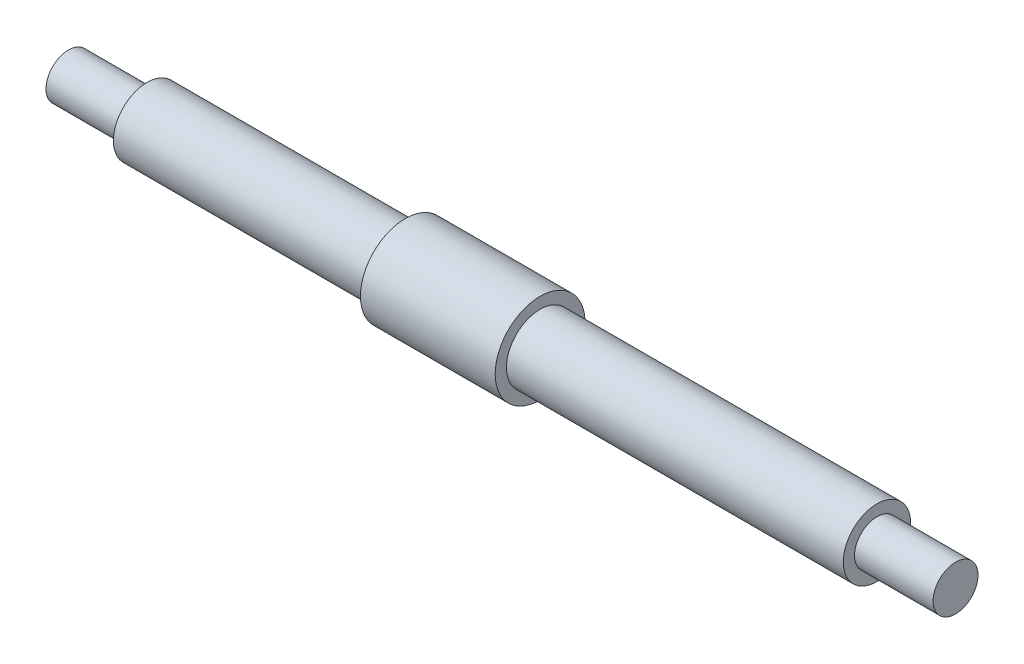
ISO-10303-21;
HEADER;
FILE_DESCRIPTION(('STEP AP214'),'2;1');
FILE_NAME('part.step','',(''),(''),'','','');
FILE_SCHEMA(('AUTOMOTIVE_DESIGN { 1 0 10303 214 1 1 1 1 }'));
ENDSEC;
DATA;
#1=APPLICATION_CONTEXT('core data for automotive mechanical design processes');
#2=APPLICATION_PROTOCOL_DEFINITION('international standard','automotive_design',2000,#1);
#3=PRODUCT_CONTEXT('',#1,'mechanical');
#4=PRODUCT('Part','Part','',(#3));
#5=PRODUCT_RELATED_PRODUCT_CATEGORY('part','',(#4));
#6=PRODUCT_DEFINITION_FORMATION('','',#4);
#7=PRODUCT_DEFINITION_CONTEXT('part definition',#1,'design');
#8=PRODUCT_DEFINITION('design','',#6,#7);
#9=PRODUCT_DEFINITION_SHAPE('','',#8);
#10=(LENGTH_UNIT() NAMED_UNIT(*) SI_UNIT(.MILLI.,.METRE.));
#11=(NAMED_UNIT(*) PLANE_ANGLE_UNIT() SI_UNIT($,.RADIAN.));
#12=(NAMED_UNIT(*) SI_UNIT($,.STERADIAN.) SOLID_ANGLE_UNIT());
#13=UNCERTAINTY_MEASURE_WITH_UNIT(LENGTH_MEASURE(1.E-05),#10,'distance_accuracy_value','');
#14=(GEOMETRIC_REPRESENTATION_CONTEXT(3) GLOBAL_UNCERTAINTY_ASSIGNED_CONTEXT((#13)) GLOBAL_UNIT_ASSIGNED_CONTEXT((#10,
#11,#12)) REPRESENTATION_CONTEXT('',''));
#15=CARTESIAN_POINT('',(0.,0.,0.));
#16=DIRECTION('',(0.,0.,1.));
#17=DIRECTION('',(1.,0.,0.));
#18=AXIS2_PLACEMENT_3D('',#15,#16,#17);
#19=CARTESIAN_POINT('',(0.,0.,0.));
#20=DIRECTION('',(1.,0.,0.));
#21=DIRECTION('',(0.,0.,-1.));
#22=AXIS2_PLACEMENT_3D('',#19,#20,#21);
#23=PLANE('',#22);
#24=CARTESIAN_POINT('',(0.,0.,0.));
#25=DIRECTION('',(-1.,0.,0.));
#26=DIRECTION('',(0.,0.,1.));
#27=AXIS2_PLACEMENT_3D('',#24,#25,#26);
#28=CIRCLE('',#27,2.);
#29=CARTESIAN_POINT('',(0.,0.,2.));
#30=VERTEX_POINT('',#29);
#31=EDGE_CURVE('E79',#30,#30,#28,.T.);
#32=ORIENTED_EDGE('',*,*,#31,.T.);
#33=EDGE_LOOP('',(#32));
#34=FACE_BOUND('',#33,.T.);
#35=ADVANCED_FACE('F45',(#34),#23,.F.);
#36=CARTESIAN_POINT('',(79.,0.,0.));
#37=DIRECTION('',(-1.,0.,0.));
#38=DIRECTION('',(0.,0.,1.));
#39=AXIS2_PLACEMENT_3D('',#36,#37,#38);
#40=PLANE('',#39);
#41=CARTESIAN_POINT('',(79.,0.,0.));
#42=DIRECTION('',(-1.,0.,0.));
#43=DIRECTION('',(0.,0.,1.));
#44=AXIS2_PLACEMENT_3D('',#41,#42,#43);
#45=CIRCLE('',#44,2.00000000000003);
#46=CARTESIAN_POINT('',(79.,0.,2.00000000000003));
#47=VERTEX_POINT('',#46);
#48=EDGE_CURVE('E12',#47,#47,#45,.T.);
#49=ORIENTED_EDGE('',*,*,#48,.F.);
#50=EDGE_LOOP('',(#49));
#51=FACE_BOUND('',#50,.T.);
#52=ADVANCED_FACE('F133',(#51),#40,.F.);
#53=CARTESIAN_POINT('',(0.,0.,0.));
#54=DIRECTION('',(-1.,0.,0.));
#55=DIRECTION('',(0.,0.,1.));
#56=AXIS2_PLACEMENT_3D('',#53,#54,#55);
#57=CYLINDRICAL_SURFACE('',#56,2.00000000000002);
#58=CARTESIAN_POINT('',(72.,0.,0.));
#59=DIRECTION('',(-1.,0.,0.));
#60=DIRECTION('',(0.,0.,1.));
#61=AXIS2_PLACEMENT_3D('',#58,#59,#60);
#62=CIRCLE('',#61,2.00000000000001);
#63=CARTESIAN_POINT('',(72.,0.,2.00000000000001));
#64=VERTEX_POINT('',#63);
#65=EDGE_CURVE('E51',#64,#64,#62,.T.);
#66=ORIENTED_EDGE('',*,*,#65,.F.);
#67=EDGE_LOOP('',(#66));
#68=FACE_BOUND('',#67,.T.);
#69=ORIENTED_EDGE('',*,*,#48,.T.);
#70=EDGE_LOOP('',(#69));
#71=FACE_BOUND('',#70,.T.);
#72=ADVANCED_FACE('F128',(#68,#71),#57,.T.);
#73=CARTESIAN_POINT('',(72.,2.00000000000001,0.));
#74=DIRECTION('',(-1.,0.,0.));
#75=DIRECTION('',(0.,0.,1.));
#76=AXIS2_PLACEMENT_3D('',#73,#74,#75);
#77=PLANE('',#76);
#78=CARTESIAN_POINT('',(72.,0.,0.));
#79=DIRECTION('',(-1.,0.,0.));
#80=DIRECTION('',(0.,0.,1.));
#81=AXIS2_PLACEMENT_3D('',#78,#79,#80);
#82=CIRCLE('',#81,3.);
#83=CARTESIAN_POINT('',(72.,0.,3.));
#84=VERTEX_POINT('',#83);
#85=EDGE_CURVE('E55',#84,#84,#82,.T.);
#86=ORIENTED_EDGE('',*,*,#85,.F.);
#87=EDGE_LOOP('',(#86));
#88=FACE_BOUND('',#87,.T.);
#89=ORIENTED_EDGE('',*,*,#65,.T.);
#90=EDGE_LOOP('',(#89));
#91=FACE_BOUND('',#90,.T.);
#92=ADVANCED_FACE('F123',(#88,#91),#77,.F.);
#93=CARTESIAN_POINT('',(0.,0.,0.));
#94=DIRECTION('',(-1.,0.,0.));
#95=DIRECTION('',(0.,0.,1.));
#96=AXIS2_PLACEMENT_3D('',#93,#94,#95);
#97=CYLINDRICAL_SURFACE('',#96,3.);
#98=CARTESIAN_POINT('',(42.,0.,0.));
#99=DIRECTION('',(-1.,0.,0.));
#100=DIRECTION('',(0.,0.,1.));
#101=AXIS2_PLACEMENT_3D('',#98,#99,#100);
#102=CIRCLE('',#101,3.);
#103=CARTESIAN_POINT('',(42.,0.,3.));
#104=VERTEX_POINT('',#103);
#105=EDGE_CURVE('E59',#104,#104,#102,.T.);
#106=ORIENTED_EDGE('',*,*,#105,.F.);
#107=EDGE_LOOP('',(#106));
#108=FACE_BOUND('',#107,.T.);
#109=ORIENTED_EDGE('',*,*,#85,.T.);
#110=EDGE_LOOP('',(#109));
#111=FACE_BOUND('',#110,.T.);
#112=ADVANCED_FACE('F117',(#108,#111),#97,.T.);
#113=CARTESIAN_POINT('',(42.,3.,0.));
#114=DIRECTION('',(-1.,0.,0.));
#115=DIRECTION('',(0.,0.,1.));
#116=AXIS2_PLACEMENT_3D('',#113,#114,#115);
#117=PLANE('',#116);
#118=CARTESIAN_POINT('',(42.,0.,0.));
#119=DIRECTION('',(-1.,0.,0.));
#120=DIRECTION('',(0.,0.,1.));
#121=AXIS2_PLACEMENT_3D('',#118,#119,#120);
#122=CIRCLE('',#121,4.);
#123=CARTESIAN_POINT('',(42.,0.,4.));
#124=VERTEX_POINT('',#123);
#125=EDGE_CURVE('E64',#124,#124,#122,.T.);
#126=ORIENTED_EDGE('',*,*,#125,.F.);
#127=EDGE_LOOP('',(#126));
#128=FACE_BOUND('',#127,.T.);
#129=ORIENTED_EDGE('',*,*,#105,.T.);
#130=EDGE_LOOP('',(#129));
#131=FACE_BOUND('',#130,.T.);
#132=ADVANCED_FACE('F111',(#128,#131),#117,.F.);
#133=CARTESIAN_POINT('',(0.,0.,0.));
#134=DIRECTION('',(-1.,0.,0.));
#135=DIRECTION('',(0.,0.,1.));
#136=AXIS2_PLACEMENT_3D('',#133,#134,#135);
#137=CYLINDRICAL_SURFACE('',#136,4.);
#138=CARTESIAN_POINT('',(30.,0.,0.));
#139=DIRECTION('',(-1.,0.,0.));
#140=DIRECTION('',(0.,0.,1.));
#141=AXIS2_PLACEMENT_3D('',#138,#139,#140);
#142=CIRCLE('',#141,4.);
#143=CARTESIAN_POINT('',(30.,0.,4.));
#144=VERTEX_POINT('',#143);
#145=EDGE_CURVE('E67',#144,#144,#142,.T.);
#146=ORIENTED_EDGE('',*,*,#145,.F.);
#147=EDGE_LOOP('',(#146));
#148=FACE_BOUND('',#147,.T.);
#149=ORIENTED_EDGE('',*,*,#125,.T.);
#150=EDGE_LOOP('',(#149));
#151=FACE_BOUND('',#150,.T.);
#152=ADVANCED_FACE('F105',(#148,#151),#137,.T.);
#153=CARTESIAN_POINT('',(30.,3.,0.));
#154=DIRECTION('',(1.,0.,0.));
#155=DIRECTION('',(0.,0.,-1.));
#156=AXIS2_PLACEMENT_3D('',#153,#154,#155);
#157=PLANE('',#156);
#158=CARTESIAN_POINT('',(30.,0.,0.));
#159=DIRECTION('',(-1.,0.,0.));
#160=DIRECTION('',(0.,0.,1.));
#161=AXIS2_PLACEMENT_3D('',#158,#159,#160);
#162=CIRCLE('',#161,3.);
#163=CARTESIAN_POINT('',(30.,0.,3.));
#164=VERTEX_POINT('',#163);
#165=EDGE_CURVE('E70',#164,#164,#162,.T.);
#166=ORIENTED_EDGE('',*,*,#165,.F.);
#167=EDGE_LOOP('',(#166));
#168=FACE_BOUND('',#167,.T.);
#169=ORIENTED_EDGE('',*,*,#145,.T.);
#170=EDGE_LOOP('',(#169));
#171=FACE_BOUND('',#170,.T.);
#172=ADVANCED_FACE('F99',(#168,#171),#157,.F.);
#173=CARTESIAN_POINT('',(0.,0.,0.));
#174=DIRECTION('',(-1.,0.,0.));
#175=DIRECTION('',(0.,0.,1.));
#176=AXIS2_PLACEMENT_3D('',#173,#174,#175);
#177=CYLINDRICAL_SURFACE('',#176,3.);
#178=CARTESIAN_POINT('',(7.,0.,0.));
#179=DIRECTION('',(-1.,0.,0.));
#180=DIRECTION('',(0.,0.,1.));
#181=AXIS2_PLACEMENT_3D('',#178,#179,#180);
#182=CIRCLE('',#181,3.);
#183=CARTESIAN_POINT('',(7.,0.,3.));
#184=VERTEX_POINT('',#183);
#185=EDGE_CURVE('E73',#184,#184,#182,.T.);
#186=ORIENTED_EDGE('',*,*,#185,.F.);
#187=EDGE_LOOP('',(#186));
#188=FACE_BOUND('',#187,.T.);
#189=ORIENTED_EDGE('',*,*,#165,.T.);
#190=EDGE_LOOP('',(#189));
#191=FACE_BOUND('',#190,.T.);
#192=ADVANCED_FACE('F93',(#188,#191),#177,.T.);
#193=CARTESIAN_POINT('',(7.,3.,0.));
#194=DIRECTION('',(1.,0.,0.));
#195=DIRECTION('',(0.,0.,-1.));
#196=AXIS2_PLACEMENT_3D('',#193,#194,#195);
#197=PLANE('',#196);
#198=CARTESIAN_POINT('',(7.,0.,0.));
#199=DIRECTION('',(-1.,0.,0.));
#200=DIRECTION('',(0.,0.,1.));
#201=AXIS2_PLACEMENT_3D('',#198,#199,#200);
#202=CIRCLE('',#201,2.);
#203=CARTESIAN_POINT('',(7.,0.,2.));
#204=VERTEX_POINT('',#203);
#205=EDGE_CURVE('E76',#204,#204,#202,.T.);
#206=ORIENTED_EDGE('',*,*,#205,.F.);
#207=EDGE_LOOP('',(#206));
#208=FACE_BOUND('',#207,.T.);
#209=ORIENTED_EDGE('',*,*,#185,.T.);
#210=EDGE_LOOP('',(#209));
#211=FACE_BOUND('',#210,.T.);
#212=ADVANCED_FACE('F87',(#208,#211),#197,.F.);
#213=CARTESIAN_POINT('',(0.,0.,0.));
#214=DIRECTION('',(-1.,0.,0.));
#215=DIRECTION('',(0.,0.,1.));
#216=AXIS2_PLACEMENT_3D('',#213,#214,#215);
#217=CYLINDRICAL_SURFACE('',#216,2.);
#218=ORIENTED_EDGE('',*,*,#31,.F.);
#219=EDGE_LOOP('',(#218));
#220=FACE_BOUND('',#219,.T.);
#221=ORIENTED_EDGE('',*,*,#205,.T.);
#222=EDGE_LOOP('',(#221));
#223=FACE_BOUND('',#222,.T.);
#224=ADVANCED_FACE('F84',(#220,#223),#217,.T.);
#225=CLOSED_SHELL('',(#35,#52,#72,#92,#112,#132,#152,#172,#192,#212,#224));
#226=MANIFOLD_SOLID_BREP('B2',#225);
#227=ADVANCED_BREP_SHAPE_REPRESENTATION('',(#18,#226),#14);
#228=SHAPE_DEFINITION_REPRESENTATION(#9,#227);
ENDSEC;
END-ISO-10303-21;
